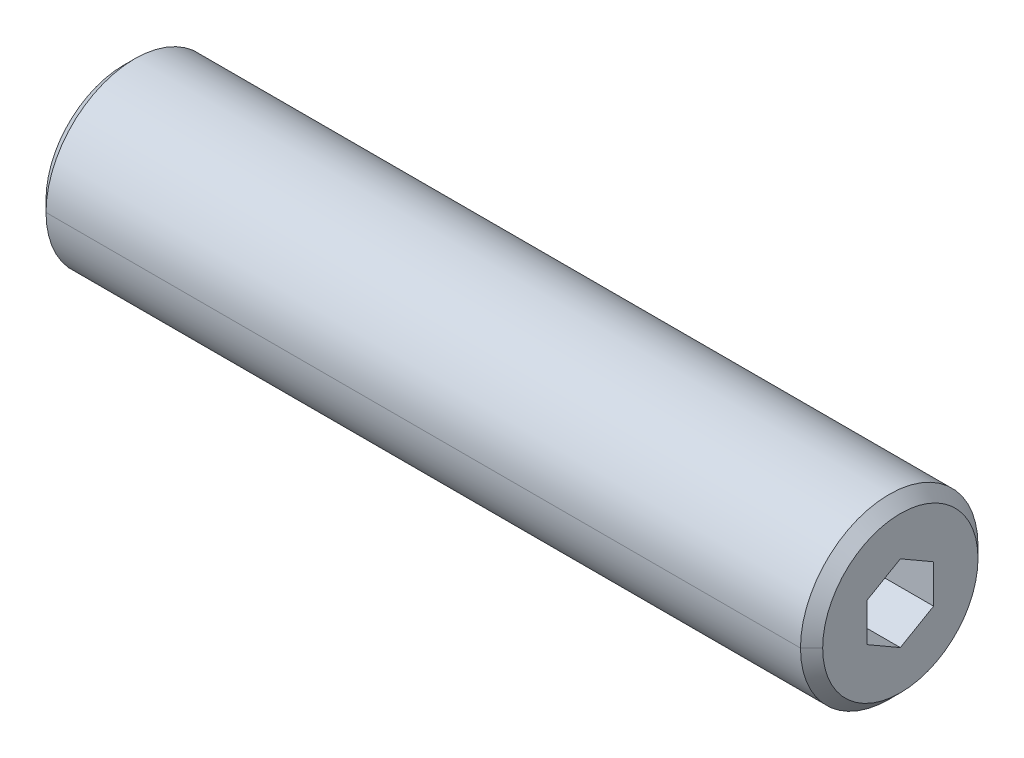
ISO-10303-21;
HEADER;
FILE_DESCRIPTION(('STEP AP214'),'2;1');
FILE_NAME('part.step','',(''),(''),'','','');
FILE_SCHEMA(('AUTOMOTIVE_DESIGN { 1 0 10303 214 1 1 1 1 }'));
ENDSEC;
DATA;
#1=APPLICATION_CONTEXT('core data for automotive mechanical design processes');
#2=APPLICATION_PROTOCOL_DEFINITION('international standard','automotive_design',2000,#1);
#3=PRODUCT_CONTEXT('',#1,'mechanical');
#4=PRODUCT('Part','Part','',(#3));
#5=PRODUCT_RELATED_PRODUCT_CATEGORY('part','',(#4));
#6=PRODUCT_DEFINITION_FORMATION('','',#4);
#7=PRODUCT_DEFINITION_CONTEXT('part definition',#1,'design');
#8=PRODUCT_DEFINITION('design','',#6,#7);
#9=PRODUCT_DEFINITION_SHAPE('','',#8);
#10=(LENGTH_UNIT() NAMED_UNIT(*) SI_UNIT(.MILLI.,.METRE.));
#11=(NAMED_UNIT(*) PLANE_ANGLE_UNIT() SI_UNIT($,.RADIAN.));
#12=(NAMED_UNIT(*) SI_UNIT($,.STERADIAN.) SOLID_ANGLE_UNIT());
#13=UNCERTAINTY_MEASURE_WITH_UNIT(LENGTH_MEASURE(1.E-05),#10,'distance_accuracy_value','');
#14=(GEOMETRIC_REPRESENTATION_CONTEXT(3) GLOBAL_UNCERTAINTY_ASSIGNED_CONTEXT((#13)) GLOBAL_UNIT_ASSIGNED_CONTEXT((#10,
#11,#12)) REPRESENTATION_CONTEXT('',''));
#15=CARTESIAN_POINT('',(0.,0.,0.));
#16=DIRECTION('',(0.,0.,1.));
#17=DIRECTION('',(1.,0.,0.));
#18=AXIS2_PLACEMENT_3D('',#15,#16,#17);
#19=CARTESIAN_POINT('',(0.,0.,0.));
#20=DIRECTION('',(1.,0.,0.));
#21=DIRECTION('',(0.,0.,-1.));
#22=AXIS2_PLACEMENT_3D('',#19,#20,#21);
#23=PLANE('',#22);
#24=CARTESIAN_POINT('',(0.,0.,0.));
#25=DIRECTION('',(1.,0.,0.));
#26=DIRECTION('',(0.,0.,-1.));
#27=AXIS2_PLACEMENT_3D('',#24,#25,#26);
#28=CIRCLE('',#27,3.5);
#29=CARTESIAN_POINT('',(0.,0.,3.5));
#30=VERTEX_POINT('',#29);
#31=CARTESIAN_POINT('',(0.,0.,-3.5));
#32=VERTEX_POINT('',#31);
#33=EDGE_CURVE('E11',#30,#32,#28,.T.);
#34=ORIENTED_EDGE('',*,*,#33,.F.);
#35=CARTESIAN_POINT('',(0.,0.,0.));
#36=DIRECTION('',(1.,0.,0.));
#37=DIRECTION('',(0.,0.,-1.));
#38=AXIS2_PLACEMENT_3D('',#35,#36,#37);
#39=CIRCLE('',#38,3.5);
#40=EDGE_CURVE('E26',#32,#30,#39,.T.);
#41=ORIENTED_EDGE('',*,*,#40,.F.);
#42=EDGE_LOOP('',(#34,#41));
#43=FACE_BOUND('',#42,.T.);
#44=CARTESIAN_POINT('',(0.,0.,0.));
#45=DIRECTION('',(1.,0.,0.));
#46=DIRECTION('',(0.,0.,-1.));
#47=AXIS2_PLACEMENT_3D('',#44,#45,#46);
#48=CIRCLE('',#47,2.5);
#49=CARTESIAN_POINT('',(0.,0.,-2.5));
#50=VERTEX_POINT('',#49);
#51=CARTESIAN_POINT('',(0.,0.,2.5));
#52=VERTEX_POINT('',#51);
#53=EDGE_CURVE('E495',#50,#52,#48,.T.);
#54=ORIENTED_EDGE('',*,*,#53,.T.);
#55=CARTESIAN_POINT('',(0.,0.,0.));
#56=DIRECTION('',(1.,0.,0.));
#57=DIRECTION('',(0.,0.,-1.));
#58=AXIS2_PLACEMENT_3D('',#55,#56,#57);
#59=CIRCLE('',#58,2.5);
#60=EDGE_CURVE('E490',#52,#50,#59,.T.);
#61=ORIENTED_EDGE('',*,*,#60,.T.);
#62=EDGE_LOOP('',(#54,#61));
#63=FACE_BOUND('',#62,.T.);
#64=ADVANCED_FACE('F17',(#43,#63),#23,.F.);
#65=CARTESIAN_POINT('',(0.,0.,0.));
#66=DIRECTION('',(-1.,0.,0.));
#67=DIRECTION('',(0.,1.,0.));
#68=AXIS2_PLACEMENT_3D('',#65,#66,#67);
#69=CONICAL_SURFACE('',#68,2.5,0.785398163397449);
#70=DIRECTION('',(-0.707106781186547,0.,-0.707106781186548));
#71=VECTOR('',#70,1.);
#72=CARTESIAN_POINT('',(0.433,0.,-2.067));
#73=LINE('',#72,#71);
#74=CARTESIAN_POINT('',(0.433,0.,-2.067));
#75=VERTEX_POINT('',#74);
#76=EDGE_CURVE('E484',#75,#50,#73,.T.);
#77=ORIENTED_EDGE('',*,*,#76,.T.);
#78=ORIENTED_EDGE('',*,*,#60,.F.);
#79=DIRECTION('',(-0.707106781186547,0.,0.707106781186548));
#80=VECTOR('',#79,1.);
#81=CARTESIAN_POINT('',(0.433,0.,2.067));
#82=LINE('',#81,#80);
#83=CARTESIAN_POINT('',(0.433,0.,2.067));
#84=VERTEX_POINT('',#83);
#85=EDGE_CURVE('E478',#84,#52,#82,.T.);
#86=ORIENTED_EDGE('',*,*,#85,.F.);
#87=CARTESIAN_POINT('',(0.433,0.,0.));
#88=DIRECTION('',(1.,0.,0.));
#89=DIRECTION('',(0.,0.,-1.));
#90=AXIS2_PLACEMENT_3D('',#87,#88,#89);
#91=CIRCLE('',#90,2.067);
#92=EDGE_CURVE('E473',#84,#75,#91,.T.);
#93=ORIENTED_EDGE('',*,*,#92,.T.);
#94=EDGE_LOOP('',(#77,#78,#86,#93));
#95=FACE_BOUND('',#94,.T.);
#96=ADVANCED_FACE('F539',(#95),#69,.F.);
#97=CARTESIAN_POINT('',(12.443383006415,0.,0.));
#98=DIRECTION('',(1.,0.,0.));
#99=DIRECTION('',(0.,1.,0.));
#100=AXIS2_PLACEMENT_3D('',#97,#98,#99);
#101=CYLINDRICAL_SURFACE('',#100,2.067);
#102=DIRECTION('',(1.,0.,0.));
#103=VECTOR('',#102,1.);
#104=CARTESIAN_POINT('',(0.433,0.,2.067));
#105=LINE('',#104,#103);
#106=CARTESIAN_POINT('',(11.25,0.,2.067));
#107=VERTEX_POINT('',#106);
#108=EDGE_CURVE('E468',#84,#107,#105,.T.);
#109=ORIENTED_EDGE('',*,*,#108,.T.);
#110=CARTESIAN_POINT('',(11.25,0.,0.));
#111=DIRECTION('',(1.,0.,0.));
#112=DIRECTION('',(0.,0.,-1.));
#113=AXIS2_PLACEMENT_3D('',#110,#111,#112);
#114=CIRCLE('',#113,2.067);
#115=CARTESIAN_POINT('',(11.25,0.,-2.067));
#116=VERTEX_POINT('',#115);
#117=EDGE_CURVE('E463',#107,#116,#114,.T.);
#118=ORIENTED_EDGE('',*,*,#117,.T.);
#119=DIRECTION('',(1.,0.,0.));
#120=VECTOR('',#119,1.);
#121=CARTESIAN_POINT('',(0.433,0.,-2.067));
#122=LINE('',#121,#120);
#123=EDGE_CURVE('E457',#75,#116,#122,.T.);
#124=ORIENTED_EDGE('',*,*,#123,.F.);
#125=ORIENTED_EDGE('',*,*,#92,.F.);
#126=EDGE_LOOP('',(#109,#118,#124,#125));
#127=FACE_BOUND('',#126,.T.);
#128=ADVANCED_FACE('F542',(#127),#101,.F.);
#129=CARTESIAN_POINT('',(12.443383006415,0.,0.));
#130=DIRECTION('',(1.,0.,0.));
#131=DIRECTION('',(0.,-1.,0.));
#132=AXIS2_PLACEMENT_3D('',#129,#130,#131);
#133=CYLINDRICAL_SURFACE('',#132,2.067);
#134=ORIENTED_EDGE('',*,*,#108,.F.);
#135=CARTESIAN_POINT('',(0.433,0.,0.));
#136=DIRECTION('',(1.,0.,0.));
#137=DIRECTION('',(0.,0.,-1.));
#138=AXIS2_PLACEMENT_3D('',#135,#136,#137);
#139=CIRCLE('',#138,2.067);
#140=EDGE_CURVE('E451',#75,#84,#139,.T.);
#141=ORIENTED_EDGE('',*,*,#140,.F.);
#142=ORIENTED_EDGE('',*,*,#123,.T.);
#143=CARTESIAN_POINT('',(11.25,0.,0.));
#144=DIRECTION('',(1.,0.,0.));
#145=DIRECTION('',(0.,0.,-1.));
#146=AXIS2_PLACEMENT_3D('',#143,#144,#145);
#147=CIRCLE('',#146,2.067);
#148=EDGE_CURVE('E445',#116,#107,#147,.T.);
#149=ORIENTED_EDGE('',*,*,#148,.T.);
#150=EDGE_LOOP('',(#134,#141,#142,#149));
#151=FACE_BOUND('',#150,.T.);
#152=ADVANCED_FACE('F557',(#151),#133,.F.);
#153=CARTESIAN_POINT('',(11.25,0.,0.));
#154=DIRECTION('',(-1.,0.,0.));
#155=DIRECTION('',(0.,-1.,0.));
#156=AXIS2_PLACEMENT_3D('',#153,#154,#155);
#157=CONICAL_SURFACE('',#156,2.067,1.04719755119658);
#158=DIRECTION('',(-0.500000000000014,0.,0.86602540378443));
#159=VECTOR('',#158,1.);
#160=CARTESIAN_POINT('',(12.443383006415,0.,0.));
#161=LINE('',#160,#159);
#162=CARTESIAN_POINT('',(12.443383006415,0.,0.));
#163=VERTEX_POINT('',#162);
#164=EDGE_CURVE('E439',#163,#107,#161,.T.);
#165=ORIENTED_EDGE('',*,*,#164,.T.);
#166=ORIENTED_EDGE('',*,*,#148,.F.);
#167=DIRECTION('',(-0.500000000000014,0.,-0.86602540378443));
#168=VECTOR('',#167,1.);
#169=CARTESIAN_POINT('',(12.443383006415,0.,0.));
#170=LINE('',#169,#168);
#171=EDGE_CURVE('E433',#163,#116,#170,.T.);
#172=ORIENTED_EDGE('',*,*,#171,.F.);
#173=EDGE_LOOP('',(#165,#166,#172));
#174=FACE_BOUND('',#173,.T.);
#175=ADVANCED_FACE('F561',(#174),#157,.F.);
#176=CARTESIAN_POINT('',(11.25,0.,0.));
#177=DIRECTION('',(-1.,0.,0.));
#178=DIRECTION('',(0.,1.,0.));
#179=AXIS2_PLACEMENT_3D('',#176,#177,#178);
#180=CONICAL_SURFACE('',#179,2.067,1.04719755119658);
#181=ORIENTED_EDGE('',*,*,#171,.T.);
#182=ORIENTED_EDGE('',*,*,#117,.F.);
#183=ORIENTED_EDGE('',*,*,#164,.F.);
#184=EDGE_LOOP('',(#181,#182,#183));
#185=FACE_BOUND('',#184,.T.);
#186=ADVANCED_FACE('F563',(#185),#180,.F.);
#187=CARTESIAN_POINT('',(0.,0.,0.));
#188=DIRECTION('',(-1.,0.,0.));
#189=DIRECTION('',(0.,-1.,0.));
#190=AXIS2_PLACEMENT_3D('',#187,#188,#189);
#191=CONICAL_SURFACE('',#190,2.5,0.785398163397449);
#192=ORIENTED_EDGE('',*,*,#76,.F.);
#193=ORIENTED_EDGE('',*,*,#140,.T.);
#194=ORIENTED_EDGE('',*,*,#85,.T.);
#195=ORIENTED_EDGE('',*,*,#53,.F.);
#196=EDGE_LOOP('',(#192,#193,#194,#195));
#197=FACE_BOUND('',#196,.T.);
#198=ADVANCED_FACE('F549',(#197),#191,.F.);
#199=CARTESIAN_POINT('',(0.,0.,0.));
#200=DIRECTION('',(1.,0.,0.));
#201=DIRECTION('',(0.,-1.,0.));
#202=AXIS2_PLACEMENT_3D('',#199,#200,#201);
#203=CONICAL_SURFACE('',#202,3.5,0.785398163397448);
#204=DIRECTION('',(0.707106781186548,0.,0.707106781186547));
#205=VECTOR('',#204,1.);
#206=CARTESIAN_POINT('',(0.,0.,3.5));
#207=LINE('',#206,#205);
#208=CARTESIAN_POINT('',(0.5,0.,4.));
#209=VERTEX_POINT('',#208);
#210=EDGE_CURVE('E428',#30,#209,#207,.T.);
#211=ORIENTED_EDGE('',*,*,#210,.T.);
#212=CARTESIAN_POINT('',(0.5,0.,0.));
#213=DIRECTION('',(1.,0.,0.));
#214=DIRECTION('',(0.,0.,-1.));
#215=AXIS2_PLACEMENT_3D('',#212,#213,#214);
#216=CIRCLE('',#215,4.);
#217=CARTESIAN_POINT('',(0.5,0.,-4.));
#218=VERTEX_POINT('',#217);
#219=EDGE_CURVE('E422',#218,#209,#216,.T.);
#220=ORIENTED_EDGE('',*,*,#219,.F.);
#221=DIRECTION('',(0.707106781186548,0.,-0.707106781186547));
#222=VECTOR('',#221,1.);
#223=CARTESIAN_POINT('',(0.,0.,-3.5));
#224=LINE('',#223,#222);
#225=EDGE_CURVE('E416',#32,#218,#224,.T.);
#226=ORIENTED_EDGE('',*,*,#225,.F.);
#227=ORIENTED_EDGE('',*,*,#40,.T.);
#228=EDGE_LOOP('',(#211,#220,#226,#227));
#229=FACE_BOUND('',#228,.T.);
#230=ADVANCED_FACE('F506',(#229),#203,.T.);
#231=CARTESIAN_POINT('',(0.,0.,0.));
#232=DIRECTION('',(1.,0.,0.));
#233=DIRECTION('',(0.,1.,0.));
#234=AXIS2_PLACEMENT_3D('',#231,#232,#233);
#235=CONICAL_SURFACE('',#234,3.5,0.785398163397448);
#236=ORIENTED_EDGE('',*,*,#210,.F.);
#237=ORIENTED_EDGE('',*,*,#33,.T.);
#238=ORIENTED_EDGE('',*,*,#225,.T.);
#239=CARTESIAN_POINT('',(0.5,0.,0.));
#240=DIRECTION('',(1.,0.,0.));
#241=DIRECTION('',(0.,0.,-1.));
#242=AXIS2_PLACEMENT_3D('',#239,#240,#241);
#243=CIRCLE('',#242,4.);
#244=EDGE_CURVE('E410',#209,#218,#243,.T.);
#245=ORIENTED_EDGE('',*,*,#244,.F.);
#246=EDGE_LOOP('',(#236,#237,#238,#245));
#247=FACE_BOUND('',#246,.T.);
#248=ADVANCED_FACE('F509',(#247),#235,.T.);
#249=CARTESIAN_POINT('',(35.,0.,0.));
#250=DIRECTION('',(1.,0.,0.));
#251=DIRECTION('',(0.,1.,-5.8935951136395E-10));
#252=AXIS2_PLACEMENT_3D('',#249,#250,#251);
#253=CYLINDRICAL_SURFACE('',#252,4.);
#254=DIRECTION('',(1.,0.,0.));
#255=VECTOR('',#254,1.);
#256=CARTESIAN_POINT('',(0.5,0.,4.));
#257=LINE('',#256,#255);
#258=CARTESIAN_POINT('',(34.5,0.,4.));
#259=VERTEX_POINT('',#258);
#260=EDGE_CURVE('E404',#209,#259,#257,.T.);
#261=ORIENTED_EDGE('',*,*,#260,.F.);
#262=ORIENTED_EDGE('',*,*,#244,.T.);
#263=DIRECTION('',(1.,0.,0.));
#264=VECTOR('',#263,1.);
#265=CARTESIAN_POINT('',(0.5,0.,-4.));
#266=LINE('',#265,#264);
#267=CARTESIAN_POINT('',(34.5,0.,-4.));
#268=VERTEX_POINT('',#267);
#269=EDGE_CURVE('E399',#218,#268,#266,.T.);
#270=ORIENTED_EDGE('',*,*,#269,.T.);
#271=CARTESIAN_POINT('',(34.5,0.,0.));
#272=DIRECTION('',(1.,0.,0.));
#273=DIRECTION('',(0.,0.,-1.));
#274=AXIS2_PLACEMENT_3D('',#271,#272,#273);
#275=CIRCLE('',#274,4.);
#276=EDGE_CURVE('E393',#259,#268,#275,.T.);
#277=ORIENTED_EDGE('',*,*,#276,.F.);
#278=EDGE_LOOP('',(#261,#262,#270,#277));
#279=FACE_BOUND('',#278,.T.);
#280=ADVANCED_FACE('F513',(#279),#253,.T.);
#281=CARTESIAN_POINT('',(34.5,0.,0.));
#282=DIRECTION('',(-1.,0.,0.));
#283=DIRECTION('',(0.,1.,0.));
#284=AXIS2_PLACEMENT_3D('',#281,#282,#283);
#285=CONICAL_SURFACE('',#284,4.,0.785398163397448);
#286=DIRECTION('',(-0.707106781186548,0.,-0.707106781186547));
#287=VECTOR('',#286,1.);
#288=CARTESIAN_POINT('',(35.,0.,-3.5));
#289=LINE('',#288,#287);
#290=CARTESIAN_POINT('',(35.,0.,-3.5));
#291=VERTEX_POINT('',#290);
#292=EDGE_CURVE('E387',#291,#268,#289,.T.);
#293=ORIENTED_EDGE('',*,*,#292,.F.);
#294=CARTESIAN_POINT('',(35.,0.,0.));
#295=DIRECTION('',(1.,0.,0.));
#296=DIRECTION('',(0.,0.,-1.));
#297=AXIS2_PLACEMENT_3D('',#294,#295,#296);
#298=CIRCLE('',#297,3.5);
#299=CARTESIAN_POINT('',(35.,0.,3.5));
#300=VERTEX_POINT('',#299);
#301=EDGE_CURVE('E381',#300,#291,#298,.T.);
#302=ORIENTED_EDGE('',*,*,#301,.F.);
#303=DIRECTION('',(-0.707106781186548,0.,0.707106781186547));
#304=VECTOR('',#303,1.);
#305=CARTESIAN_POINT('',(35.,0.,3.5));
#306=LINE('',#305,#304);
#307=EDGE_CURVE('E375',#300,#259,#306,.T.);
#308=ORIENTED_EDGE('',*,*,#307,.T.);
#309=ORIENTED_EDGE('',*,*,#276,.T.);
#310=EDGE_LOOP('',(#293,#302,#308,#309));
#311=FACE_BOUND('',#310,.T.);
#312=ADVANCED_FACE('F522',(#311),#285,.T.);
#313=CARTESIAN_POINT('',(34.5,0.,0.));
#314=DIRECTION('',(-1.,0.,0.));
#315=DIRECTION('',(0.,-1.,0.));
#316=AXIS2_PLACEMENT_3D('',#313,#314,#315);
#317=CONICAL_SURFACE('',#316,4.,0.785398163397448);
#318=ORIENTED_EDGE('',*,*,#292,.T.);
#319=CARTESIAN_POINT('',(34.5,0.,0.));
#320=DIRECTION('',(1.,0.,0.));
#321=DIRECTION('',(0.,0.,-1.));
#322=AXIS2_PLACEMENT_3D('',#319,#320,#321);
#323=CIRCLE('',#322,4.);
#324=EDGE_CURVE('E369',#268,#259,#323,.T.);
#325=ORIENTED_EDGE('',*,*,#324,.T.);
#326=ORIENTED_EDGE('',*,*,#307,.F.);
#327=CARTESIAN_POINT('',(35.,0.,0.));
#328=DIRECTION('',(1.,0.,0.));
#329=DIRECTION('',(0.,0.,-1.));
#330=AXIS2_PLACEMENT_3D('',#327,#328,#329);
#331=CIRCLE('',#330,3.5);
#332=EDGE_CURVE('E363',#291,#300,#331,.T.);
#333=ORIENTED_EDGE('',*,*,#332,.F.);
#334=EDGE_LOOP('',(#318,#325,#326,#333));
#335=FACE_BOUND('',#334,.T.);
#336=ADVANCED_FACE('F520',(#335),#317,.T.);
#337=CARTESIAN_POINT('',(35.,3.5,0.));
#338=DIRECTION('',(-1.,0.,0.));
#339=DIRECTION('',(0.,0.,1.));
#340=AXIS2_PLACEMENT_3D('',#337,#338,#339);
#341=PLANE('',#340);
#342=DIRECTION('',(0.,-0.500000000000009,0.866025403784433));
#343=VECTOR('',#342,1.);
#344=CARTESIAN_POINT('',(35.,1.7320508075689,0.));
#345=LINE('',#344,#343);
#346=CARTESIAN_POINT('',(35.,1.7320508075689,0.));
#347=VERTEX_POINT('',#346);
#348=CARTESIAN_POINT('',(35.,0.86602540378444,1.5));
#349=VERTEX_POINT('',#348);
#350=EDGE_CURVE('E357',#347,#349,#345,.T.);
#351=ORIENTED_EDGE('',*,*,#350,.F.);
#352=DIRECTION('',(0.,0.500000000000009,0.866025403784433));
#353=VECTOR('',#352,1.);
#354=CARTESIAN_POINT('',(35.,0.86602540378444,-1.5));
#355=LINE('',#354,#353);
#356=CARTESIAN_POINT('',(35.,0.86602540378444,-1.5));
#357=VERTEX_POINT('',#356);
#358=EDGE_CURVE('E351',#357,#347,#355,.T.);
#359=ORIENTED_EDGE('',*,*,#358,.F.);
#360=DIRECTION('',(0.,1.,0.));
#361=VECTOR('',#360,1.);
#362=CARTESIAN_POINT('',(35.,-0.86602540378444,-1.5));
#363=LINE('',#362,#361);
#364=CARTESIAN_POINT('',(35.,-0.86602540378444,-1.5));
#365=VERTEX_POINT('',#364);
#366=EDGE_CURVE('E345',#365,#357,#363,.T.);
#367=ORIENTED_EDGE('',*,*,#366,.F.);
#368=DIRECTION('',(0.,0.500000000000009,-0.866025403784433));
#369=VECTOR('',#368,1.);
#370=CARTESIAN_POINT('',(35.,-1.7320508075689,0.));
#371=LINE('',#370,#369);
#372=CARTESIAN_POINT('',(35.,-1.7320508075689,0.));
#373=VERTEX_POINT('',#372);
#374=EDGE_CURVE('E340',#373,#365,#371,.T.);
#375=ORIENTED_EDGE('',*,*,#374,.F.);
#376=DIRECTION('',(0.,-0.500000000000009,-0.866025403784433));
#377=VECTOR('',#376,1.);
#378=CARTESIAN_POINT('',(35.,-0.86602540378444,1.5));
#379=LINE('',#378,#377);
#380=CARTESIAN_POINT('',(35.,-0.86602540378444,1.5));
#381=VERTEX_POINT('',#380);
#382=EDGE_CURVE('E196',#381,#373,#379,.T.);
#383=ORIENTED_EDGE('',*,*,#382,.F.);
#384=DIRECTION('',(0.,-1.,0.));
#385=VECTOR('',#384,1.);
#386=CARTESIAN_POINT('',(35.,0.86602540378444,1.5));
#387=LINE('',#386,#385);
#388=EDGE_CURVE('E331',#349,#381,#387,.T.);
#389=ORIENTED_EDGE('',*,*,#388,.F.);
#390=EDGE_LOOP('',(#351,#359,#367,#375,#383,#389));
#391=FACE_BOUND('',#390,.T.);
#392=ORIENTED_EDGE('',*,*,#332,.T.);
#393=ORIENTED_EDGE('',*,*,#301,.T.);
#394=EDGE_LOOP('',(#392,#393));
#395=FACE_BOUND('',#394,.T.);
#396=ADVANCED_FACE('F524',(#391,#395),#341,.F.);
#397=CARTESIAN_POINT('',(30.5,0.86602540378444,1.5));
#398=DIRECTION('',(0.,0.,1.));
#399=DIRECTION('',(1.,0.,0.));
#400=AXIS2_PLACEMENT_3D('',#397,#398,#399);
#401=PLANE('',#400);
#402=DIRECTION('',(0.,-1.,0.));
#403=VECTOR('',#402,1.);
#404=CARTESIAN_POINT('',(30.5,0.86602540378444,1.5));
#405=LINE('',#404,#403);
#406=CARTESIAN_POINT('',(30.5,0.86602540378444,1.5));
#407=VERTEX_POINT('',#406);
#408=CARTESIAN_POINT('',(30.5,0.,1.5));
#409=VERTEX_POINT('',#408);
#410=EDGE_CURVE('E325',#407,#409,#405,.T.);
#411=ORIENTED_EDGE('',*,*,#410,.F.);
#412=DIRECTION('',(1.,0.,0.));
#413=VECTOR('',#412,1.);
#414=CARTESIAN_POINT('',(30.5,0.86602540378444,1.5));
#415=LINE('',#414,#413);
#416=EDGE_CURVE('E319',#407,#349,#415,.T.);
#417=ORIENTED_EDGE('',*,*,#416,.T.);
#418=ORIENTED_EDGE('',*,*,#388,.T.);
#419=DIRECTION('',(1.,0.,0.));
#420=VECTOR('',#419,1.);
#421=CARTESIAN_POINT('',(30.5,-0.86602540378444,1.5));
#422=LINE('',#421,#420);
#423=CARTESIAN_POINT('',(30.5,-0.86602540378444,1.5));
#424=VERTEX_POINT('',#423);
#425=EDGE_CURVE('E314',#424,#381,#422,.T.);
#426=ORIENTED_EDGE('',*,*,#425,.F.);
#427=DIRECTION('',(0.,-1.,0.));
#428=VECTOR('',#427,1.);
#429=CARTESIAN_POINT('',(30.5,0.86602540378444,1.5));
#430=LINE('',#429,#428);
#431=EDGE_CURVE('E308',#409,#424,#430,.T.);
#432=ORIENTED_EDGE('',*,*,#431,.F.);
#433=EDGE_LOOP('',(#411,#417,#418,#426,#432));
#434=FACE_BOUND('',#433,.T.);
#435=ADVANCED_FACE('F526',(#434),#401,.F.);
#436=CARTESIAN_POINT('',(30.5,0.,0.));
#437=DIRECTION('',(1.,0.,0.));
#438=DIRECTION('',(0.,0.,-1.));
#439=AXIS2_PLACEMENT_3D('',#436,#437,#438);
#440=PLANE('',#439);
#441=ORIENTED_EDGE('',*,*,#431,.T.);
#442=DIRECTION('',(0.,-0.500000000000009,-0.866025403784433));
#443=VECTOR('',#442,1.);
#444=CARTESIAN_POINT('',(30.5,-0.86602540378444,1.5));
#445=LINE('',#444,#443);
#446=CARTESIAN_POINT('',(30.5,-1.29903810567666,0.750000000000019));
#447=VERTEX_POINT('',#446);
#448=EDGE_CURVE('E303',#424,#447,#445,.T.);
#449=ORIENTED_EDGE('',*,*,#448,.T.);
#450=CARTESIAN_POINT('',(30.5,0.,0.));
#451=DIRECTION('',(1.,0.,0.));
#452=DIRECTION('',(0.,0.,-1.));
#453=AXIS2_PLACEMENT_3D('',#450,#451,#452);
#454=CIRCLE('',#453,1.5);
#455=EDGE_CURVE('E298',#409,#447,#454,.T.);
#456=ORIENTED_EDGE('',*,*,#455,.F.);
#457=EDGE_LOOP('',(#441,#449,#456));
#458=FACE_BOUND('',#457,.T.);
#459=ADVANCED_FACE('F533',(#458),#440,.T.);
#460=CARTESIAN_POINT('',(29.633974596216,0.,0.));
#461=DIRECTION('',(1.,0.,0.));
#462=DIRECTION('',(0.,1.,0.));
#463=AXIS2_PLACEMENT_3D('',#460,#461,#462);
#464=CONICAL_SURFACE('',#463,0.,1.04719755119682);
#465=DIRECTION('',(0.49999999999981,0.,0.866025403784548));
#466=VECTOR('',#465,1.);
#467=CARTESIAN_POINT('',(29.633974596216,0.,0.));
#468=LINE('',#467,#466);
#469=CARTESIAN_POINT('',(29.633974596216,0.,0.));
#470=VERTEX_POINT('',#469);
#471=EDGE_CURVE('E292',#470,#409,#468,.T.);
#472=ORIENTED_EDGE('',*,*,#471,.T.);
#473=ORIENTED_EDGE('',*,*,#455,.T.);
#474=CARTESIAN_POINT('',(30.5,0.,0.));
#475=DIRECTION('',(1.,0.,0.));
#476=DIRECTION('',(0.,0.,-1.));
#477=AXIS2_PLACEMENT_3D('',#474,#475,#476);
#478=CIRCLE('',#477,1.5);
#479=CARTESIAN_POINT('',(30.5,-1.29903810567666,-0.750000000000019));
#480=VERTEX_POINT('',#479);
#481=EDGE_CURVE('E188',#447,#480,#478,.T.);
#482=ORIENTED_EDGE('',*,*,#481,.T.);
#483=CARTESIAN_POINT('',(30.5,0.,0.));
#484=DIRECTION('',(1.,0.,0.));
#485=DIRECTION('',(0.,0.,-1.));
#486=AXIS2_PLACEMENT_3D('',#483,#484,#485);
#487=CIRCLE('',#486,1.5);
#488=CARTESIAN_POINT('',(30.5,0.,-1.5));
#489=VERTEX_POINT('',#488);
#490=EDGE_CURVE('E283',#480,#489,#487,.T.);
#491=ORIENTED_EDGE('',*,*,#490,.T.);
#492=DIRECTION('',(0.49999999999981,0.,-0.866025403784548));
#493=VECTOR('',#492,1.);
#494=CARTESIAN_POINT('',(29.633974596216,0.,0.));
#495=LINE('',#494,#493);
#496=EDGE_CURVE('E277',#470,#489,#495,.T.);
#497=ORIENTED_EDGE('',*,*,#496,.F.);
#498=EDGE_LOOP('',(#472,#473,#482,#491,#497));
#499=FACE_BOUND('',#498,.T.);
#500=ADVANCED_FACE('F711',(#499),#464,.F.);
#501=CARTESIAN_POINT('',(29.633974596216,0.,0.));
#502=DIRECTION('',(1.,0.,0.));
#503=DIRECTION('',(0.,-1.,0.));
#504=AXIS2_PLACEMENT_3D('',#501,#502,#503);
#505=CONICAL_SURFACE('',#504,0.,1.04719755119682);
#506=ORIENTED_EDGE('',*,*,#496,.T.);
#507=CARTESIAN_POINT('',(30.5,0.,0.));
#508=DIRECTION('',(1.,0.,0.));
#509=DIRECTION('',(0.,0.,-1.));
#510=AXIS2_PLACEMENT_3D('',#507,#508,#509);
#511=CIRCLE('',#510,1.5);
#512=CARTESIAN_POINT('',(30.5,1.29903810567666,-0.750000000000019));
#513=VERTEX_POINT('',#512);
#514=EDGE_CURVE('E272',#489,#513,#511,.T.);
#515=ORIENTED_EDGE('',*,*,#514,.T.);
#516=CARTESIAN_POINT('',(30.5,0.,0.));
#517=DIRECTION('',(1.,0.,0.));
#518=DIRECTION('',(0.,0.,-1.));
#519=AXIS2_PLACEMENT_3D('',#516,#517,#518);
#520=CIRCLE('',#519,1.5);
#521=CARTESIAN_POINT('',(30.5,1.29903810567666,0.750000000000019));
#522=VERTEX_POINT('',#521);
#523=EDGE_CURVE('E267',#513,#522,#520,.T.);
#524=ORIENTED_EDGE('',*,*,#523,.T.);
#525=CARTESIAN_POINT('',(30.5,0.,0.));
#526=DIRECTION('',(1.,0.,0.));
#527=DIRECTION('',(0.,0.,-1.));
#528=AXIS2_PLACEMENT_3D('',#525,#526,#527);
#529=CIRCLE('',#528,1.5);
#530=EDGE_CURVE('E261',#522,#409,#529,.T.);
#531=ORIENTED_EDGE('',*,*,#530,.T.);
#532=ORIENTED_EDGE('',*,*,#471,.F.);
#533=EDGE_LOOP('',(#506,#515,#524,#531,#532));
#534=FACE_BOUND('',#533,.T.);
#535=ADVANCED_FACE('F722',(#534),#505,.F.);
#536=CARTESIAN_POINT('',(30.5,0.,0.));
#537=DIRECTION('',(1.,0.,0.));
#538=DIRECTION('',(0.,0.,-1.));
#539=AXIS2_PLACEMENT_3D('',#536,#537,#538);
#540=PLANE('',#539);
#541=DIRECTION('',(0.,-0.500000000000009,0.866025403784433));
#542=VECTOR('',#541,1.);
#543=CARTESIAN_POINT('',(30.5,1.7320508075689,0.));
#544=LINE('',#543,#542);
#545=EDGE_CURVE('E255',#522,#407,#544,.T.);
#546=ORIENTED_EDGE('',*,*,#545,.T.);
#547=ORIENTED_EDGE('',*,*,#410,.T.);
#548=ORIENTED_EDGE('',*,*,#530,.F.);
#549=EDGE_LOOP('',(#546,#547,#548));
#550=FACE_BOUND('',#549,.T.);
#551=ADVANCED_FACE('F733',(#550),#540,.T.);
#552=CARTESIAN_POINT('',(30.5,1.7320508075689,0.));
#553=DIRECTION('',(0.,0.866025403784434,0.500000000000009));
#554=DIRECTION('',(0.,-0.500000000000009,0.866025403784434));
#555=AXIS2_PLACEMENT_3D('',#552,#553,#554);
#556=PLANE('',#555);
#557=DIRECTION('',(0.,-0.500000000000009,0.866025403784433));
#558=VECTOR('',#557,1.);
#559=CARTESIAN_POINT('',(30.5,1.7320508075689,0.));
#560=LINE('',#559,#558);
#561=CARTESIAN_POINT('',(30.5,1.7320508075689,0.));
#562=VERTEX_POINT('',#561);
#563=EDGE_CURVE('E249',#562,#522,#560,.T.);
#564=ORIENTED_EDGE('',*,*,#563,.F.);
#565=DIRECTION('',(1.,0.,0.));
#566=VECTOR('',#565,1.);
#567=CARTESIAN_POINT('',(30.5,1.7320508075689,0.));
#568=LINE('',#567,#566);
#569=EDGE_CURVE('E243',#562,#347,#568,.T.);
#570=ORIENTED_EDGE('',*,*,#569,.T.);
#571=ORIENTED_EDGE('',*,*,#350,.T.);
#572=ORIENTED_EDGE('',*,*,#416,.F.);
#573=ORIENTED_EDGE('',*,*,#545,.F.);
#574=EDGE_LOOP('',(#564,#570,#571,#572,#573));
#575=FACE_BOUND('',#574,.T.);
#576=ADVANCED_FACE('F744',(#575),#556,.F.);
#577=CARTESIAN_POINT('',(30.5,0.86602540378444,-1.5));
#578=DIRECTION('',(0.,0.866025403784434,-0.500000000000009));
#579=DIRECTION('',(0.,0.500000000000009,0.866025403784434));
#580=AXIS2_PLACEMENT_3D('',#577,#578,#579);
#581=PLANE('',#580);
#582=DIRECTION('',(0.,0.500000000000009,0.866025403784433));
#583=VECTOR('',#582,1.);
#584=CARTESIAN_POINT('',(30.5,0.86602540378444,-1.5));
#585=LINE('',#584,#583);
#586=CARTESIAN_POINT('',(30.5,0.86602540378444,-1.5));
#587=VERTEX_POINT('',#586);
#588=EDGE_CURVE('E237',#587,#513,#585,.T.);
#589=ORIENTED_EDGE('',*,*,#588,.F.);
#590=DIRECTION('',(1.,0.,0.));
#591=VECTOR('',#590,1.);
#592=CARTESIAN_POINT('',(30.5,0.86602540378444,-1.5));
#593=LINE('',#592,#591);
#594=EDGE_CURVE('E231',#587,#357,#593,.T.);
#595=ORIENTED_EDGE('',*,*,#594,.T.);
#596=ORIENTED_EDGE('',*,*,#358,.T.);
#597=ORIENTED_EDGE('',*,*,#569,.F.);
#598=DIRECTION('',(0.,0.500000000000009,0.866025403784433));
#599=VECTOR('',#598,1.);
#600=CARTESIAN_POINT('',(30.5,0.86602540378444,-1.5));
#601=LINE('',#600,#599);
#602=EDGE_CURVE('E225',#513,#562,#601,.T.);
#603=ORIENTED_EDGE('',*,*,#602,.F.);
#604=EDGE_LOOP('',(#589,#595,#596,#597,#603));
#605=FACE_BOUND('',#604,.T.);
#606=ADVANCED_FACE('F755',(#605),#581,.F.);
#607=CARTESIAN_POINT('',(30.5,0.,0.));
#608=DIRECTION('',(1.,0.,0.));
#609=DIRECTION('',(0.,0.,-1.));
#610=AXIS2_PLACEMENT_3D('',#607,#608,#609);
#611=PLANE('',#610);
#612=ORIENTED_EDGE('',*,*,#602,.T.);
#613=ORIENTED_EDGE('',*,*,#563,.T.);
#614=ORIENTED_EDGE('',*,*,#523,.F.);
#615=EDGE_LOOP('',(#612,#613,#614));
#616=FACE_BOUND('',#615,.T.);
#617=ADVANCED_FACE('F766',(#616),#611,.T.);
#618=CARTESIAN_POINT('',(30.5,-0.86602540378444,-1.5));
#619=DIRECTION('',(0.,0.,-1.));
#620=DIRECTION('',(-1.,0.,0.));
#621=AXIS2_PLACEMENT_3D('',#618,#619,#620);
#622=PLANE('',#621);
#623=DIRECTION('',(0.,1.,0.));
#624=VECTOR('',#623,1.);
#625=CARTESIAN_POINT('',(30.5,-0.86602540378444,-1.5));
#626=LINE('',#625,#624);
#627=CARTESIAN_POINT('',(30.5,-0.86602540378444,-1.5));
#628=VERTEX_POINT('',#627);
#629=EDGE_CURVE('E219',#628,#489,#626,.T.);
#630=ORIENTED_EDGE('',*,*,#629,.F.);
#631=DIRECTION('',(1.,0.,0.));
#632=VECTOR('',#631,1.);
#633=CARTESIAN_POINT('',(30.5,-0.86602540378444,-1.5));
#634=LINE('',#633,#632);
#635=EDGE_CURVE('E213',#628,#365,#634,.T.);
#636=ORIENTED_EDGE('',*,*,#635,.T.);
#637=ORIENTED_EDGE('',*,*,#366,.T.);
#638=ORIENTED_EDGE('',*,*,#594,.F.);
#639=DIRECTION('',(0.,1.,0.));
#640=VECTOR('',#639,1.);
#641=CARTESIAN_POINT('',(30.5,-0.86602540378444,-1.5));
#642=LINE('',#641,#640);
#643=EDGE_CURVE('E183',#489,#587,#642,.T.);
#644=ORIENTED_EDGE('',*,*,#643,.F.);
#645=EDGE_LOOP('',(#630,#636,#637,#638,#644));
#646=FACE_BOUND('',#645,.T.);
#647=ADVANCED_FACE('F777',(#646),#622,.F.);
#648=CARTESIAN_POINT('',(30.5,0.,0.));
#649=DIRECTION('',(1.,0.,0.));
#650=DIRECTION('',(0.,0.,-1.));
#651=AXIS2_PLACEMENT_3D('',#648,#649,#650);
#652=PLANE('',#651);
#653=ORIENTED_EDGE('',*,*,#643,.T.);
#654=ORIENTED_EDGE('',*,*,#588,.T.);
#655=ORIENTED_EDGE('',*,*,#514,.F.);
#656=EDGE_LOOP('',(#653,#654,#655));
#657=FACE_BOUND('',#656,.T.);
#658=ADVANCED_FACE('F788',(#657),#652,.T.);
#659=CARTESIAN_POINT('',(30.5,-1.7320508075689,0.));
#660=DIRECTION('',(0.,-0.866025403784434,-0.500000000000009));
#661=DIRECTION('',(0.,0.500000000000009,-0.866025403784434));
#662=AXIS2_PLACEMENT_3D('',#659,#660,#661);
#663=PLANE('',#662);
#664=DIRECTION('',(0.,0.500000000000009,-0.866025403784433));
#665=VECTOR('',#664,1.);
#666=CARTESIAN_POINT('',(30.5,-1.7320508075689,0.));
#667=LINE('',#666,#665);
#668=CARTESIAN_POINT('',(30.5,-1.7320508075689,0.));
#669=VERTEX_POINT('',#668);
#670=EDGE_CURVE('E169',#669,#480,#667,.T.);
#671=ORIENTED_EDGE('',*,*,#670,.F.);
#672=DIRECTION('',(1.,0.,0.));
#673=VECTOR('',#672,1.);
#674=CARTESIAN_POINT('',(30.5,-1.7320508075689,0.));
#675=LINE('',#674,#673);
#676=EDGE_CURVE('E174',#669,#373,#675,.T.);
#677=ORIENTED_EDGE('',*,*,#676,.T.);
#678=ORIENTED_EDGE('',*,*,#374,.T.);
#679=ORIENTED_EDGE('',*,*,#635,.F.);
#680=DIRECTION('',(0.,0.500000000000009,-0.866025403784433));
#681=VECTOR('',#680,1.);
#682=CARTESIAN_POINT('',(30.5,-1.7320508075689,0.));
#683=LINE('',#682,#681);
#684=EDGE_CURVE('E178',#480,#628,#683,.T.);
#685=ORIENTED_EDGE('',*,*,#684,.F.);
#686=EDGE_LOOP('',(#671,#677,#678,#679,#685));
#687=FACE_BOUND('',#686,.T.);
#688=ADVANCED_FACE('F171',(#687),#663,.F.);
#689=CARTESIAN_POINT('',(30.5,0.,0.));
#690=DIRECTION('',(1.,0.,0.));
#691=DIRECTION('',(0.,0.,-1.));
#692=AXIS2_PLACEMENT_3D('',#689,#690,#691);
#693=PLANE('',#692);
#694=ORIENTED_EDGE('',*,*,#684,.T.);
#695=ORIENTED_EDGE('',*,*,#629,.T.);
#696=ORIENTED_EDGE('',*,*,#490,.F.);
#697=EDGE_LOOP('',(#694,#695,#696));
#698=FACE_BOUND('',#697,.T.);
#699=ADVANCED_FACE('F809',(#698),#693,.T.);
#700=CARTESIAN_POINT('',(30.5,-0.86602540378444,1.5));
#701=DIRECTION('',(0.,-0.866025403784434,0.500000000000009));
#702=DIRECTION('',(0.,-0.500000000000009,-0.866025403784434));
#703=AXIS2_PLACEMENT_3D('',#700,#701,#702);
#704=PLANE('',#703);
#705=ORIENTED_EDGE('',*,*,#448,.F.);
#706=ORIENTED_EDGE('',*,*,#425,.T.);
#707=ORIENTED_EDGE('',*,*,#382,.T.);
#708=ORIENTED_EDGE('',*,*,#676,.F.);
#709=DIRECTION('',(0.,-0.500000000000009,-0.866025403784433));
#710=VECTOR('',#709,1.);
#711=CARTESIAN_POINT('',(30.5,-0.86602540378444,1.5));
#712=LINE('',#711,#710);
#713=EDGE_CURVE('E186',#447,#669,#712,.T.);
#714=ORIENTED_EDGE('',*,*,#713,.F.);
#715=EDGE_LOOP('',(#705,#706,#707,#708,#714));
#716=FACE_BOUND('',#715,.T.);
#717=ADVANCED_FACE('F194',(#716),#704,.F.);
#718=CARTESIAN_POINT('',(30.5,0.,0.));
#719=DIRECTION('',(1.,0.,0.));
#720=DIRECTION('',(0.,0.,-1.));
#721=AXIS2_PLACEMENT_3D('',#718,#719,#720);
#722=PLANE('',#721);
#723=ORIENTED_EDGE('',*,*,#713,.T.);
#724=ORIENTED_EDGE('',*,*,#670,.T.);
#725=ORIENTED_EDGE('',*,*,#481,.F.);
#726=EDGE_LOOP('',(#723,#724,#725));
#727=FACE_BOUND('',#726,.T.);
#728=ADVANCED_FACE('F187',(#727),#722,.T.);
#729=CARTESIAN_POINT('',(35.,0.,0.));
#730=DIRECTION('',(1.,0.,0.));
#731=DIRECTION('',(0.,-1.,-5.8935951136395E-10));
#732=AXIS2_PLACEMENT_3D('',#729,#730,#731);
#733=CYLINDRICAL_SURFACE('',#732,4.);
#734=ORIENTED_EDGE('',*,*,#260,.T.);
#735=ORIENTED_EDGE('',*,*,#324,.F.);
#736=ORIENTED_EDGE('',*,*,#269,.F.);
#737=ORIENTED_EDGE('',*,*,#219,.T.);
#738=EDGE_LOOP('',(#734,#735,#736,#737));
#739=FACE_BOUND('',#738,.T.);
#740=ADVANCED_FACE('F516',(#739),#733,.T.);
#741=CLOSED_SHELL('',(#64,#96,#128,#152,#175,#186,#198,#230,#248,#280,#312,#336,#396,#435,#459,
#500,#535,#551,#576,#606,#617,#647,#658,#688,#699,#717,#728,#740));
#742=MANIFOLD_SOLID_BREP('B1',#741);
#743=ADVANCED_BREP_SHAPE_REPRESENTATION('',(#18,#742),#14);
#744=SHAPE_DEFINITION_REPRESENTATION(#9,#743);
ENDSEC;
END-ISO-10303-21;
